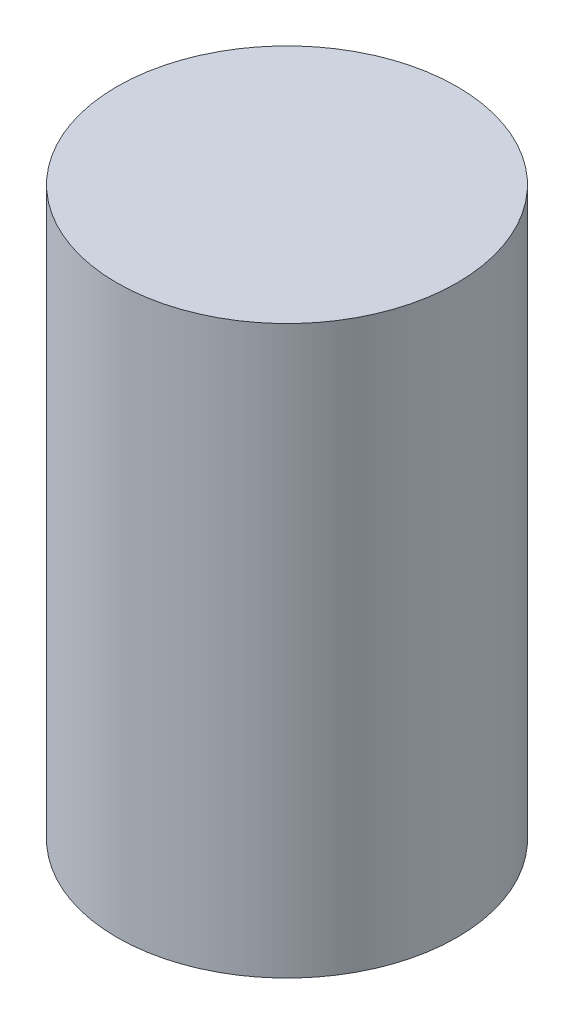
ISO-10303-21;
HEADER;
FILE_DESCRIPTION(('STEP AP214'),'2;1');
FILE_NAME('part.step','',(''),(''),'','','');
FILE_SCHEMA(('AUTOMOTIVE_DESIGN { 1 0 10303 214 1 1 1 1 }'));
ENDSEC;
DATA;
#1=APPLICATION_CONTEXT('core data for automotive mechanical design processes');
#2=APPLICATION_PROTOCOL_DEFINITION('international standard','automotive_design',2000,#1);
#3=PRODUCT_CONTEXT('',#1,'mechanical');
#4=PRODUCT('Part','Part','',(#3));
#5=PRODUCT_RELATED_PRODUCT_CATEGORY('part','',(#4));
#6=PRODUCT_DEFINITION_FORMATION('','',#4);
#7=PRODUCT_DEFINITION_CONTEXT('part definition',#1,'design');
#8=PRODUCT_DEFINITION('design','',#6,#7);
#9=PRODUCT_DEFINITION_SHAPE('','',#8);
#10=(LENGTH_UNIT() NAMED_UNIT(*) SI_UNIT(.MILLI.,.METRE.));
#11=(NAMED_UNIT(*) PLANE_ANGLE_UNIT() SI_UNIT($,.RADIAN.));
#12=(NAMED_UNIT(*) SI_UNIT($,.STERADIAN.) SOLID_ANGLE_UNIT());
#13=UNCERTAINTY_MEASURE_WITH_UNIT(LENGTH_MEASURE(1.E-05),#10,'distance_accuracy_value','');
#14=(GEOMETRIC_REPRESENTATION_CONTEXT(3) GLOBAL_UNCERTAINTY_ASSIGNED_CONTEXT((#13)) GLOBAL_UNIT_ASSIGNED_CONTEXT((#10,
#11,#12)) REPRESENTATION_CONTEXT('',''));
#15=CARTESIAN_POINT('',(0.,0.,0.));
#16=DIRECTION('',(0.,0.,1.));
#17=DIRECTION('',(1.,0.,0.));
#18=AXIS2_PLACEMENT_3D('',#15,#16,#17);
#19=CARTESIAN_POINT('',(0.,127.,0.));
#20=DIRECTION('',(0.,-1.,0.));
#21=DIRECTION('',(0.,0.,-1.));
#22=AXIS2_PLACEMENT_3D('',#19,#20,#21);
#23=CYLINDRICAL_SURFACE('',#22,38.1);
#24=CARTESIAN_POINT('',(0.,127.,0.));
#25=DIRECTION('',(0.,1.,0.));
#26=DIRECTION('',(0.,0.,1.));
#27=AXIS2_PLACEMENT_3D('',#24,#25,#26);
#28=CIRCLE('',#27,38.1);
#29=CARTESIAN_POINT('',(0.,127.,38.1));
#30=VERTEX_POINT('',#29);
#31=EDGE_CURVE('E10',#30,#30,#28,.T.);
#32=ORIENTED_EDGE('',*,*,#31,.F.);
#33=EDGE_LOOP('',(#32));
#34=FACE_BOUND('',#33,.T.);
#35=CARTESIAN_POINT('',(0.,0.,0.));
#36=DIRECTION('',(0.,1.,0.));
#37=DIRECTION('',(0.,0.,1.));
#38=AXIS2_PLACEMENT_3D('',#35,#36,#37);
#39=CIRCLE('',#38,38.1);
#40=CARTESIAN_POINT('',(0.,0.,38.1));
#41=VERTEX_POINT('',#40);
#42=EDGE_CURVE('E35',#41,#41,#39,.T.);
#43=ORIENTED_EDGE('',*,*,#42,.T.);
#44=EDGE_LOOP('',(#43));
#45=FACE_BOUND('',#44,.T.);
#46=ADVANCED_FACE('F32',(#34,#45),#23,.T.);
#47=CARTESIAN_POINT('',(0.,127.,0.));
#48=DIRECTION('',(0.,1.,0.));
#49=DIRECTION('',(0.,0.,1.));
#50=AXIS2_PLACEMENT_3D('',#47,#48,#49);
#51=PLANE('',#50);
#52=ORIENTED_EDGE('',*,*,#31,.T.);
#53=EDGE_LOOP('',(#52));
#54=FACE_BOUND('',#53,.T.);
#55=ADVANCED_FACE('F47',(#54),#51,.T.);
#56=CARTESIAN_POINT('',(0.,0.,0.));
#57=DIRECTION('',(0.,1.,0.));
#58=DIRECTION('',(0.,0.,1.));
#59=AXIS2_PLACEMENT_3D('',#56,#57,#58);
#60=PLANE('',#59);
#61=ORIENTED_EDGE('',*,*,#42,.F.);
#62=EDGE_LOOP('',(#61));
#63=FACE_BOUND('',#62,.T.);
#64=ADVANCED_FACE('F45',(#63),#60,.F.);
#65=CLOSED_SHELL('',(#46,#55,#64));
#66=MANIFOLD_SOLID_BREP('B2',#65);
#67=ADVANCED_BREP_SHAPE_REPRESENTATION('',(#18,#66),#14);
#68=SHAPE_DEFINITION_REPRESENTATION(#9,#67);
ENDSEC;
END-ISO-10303-21;
